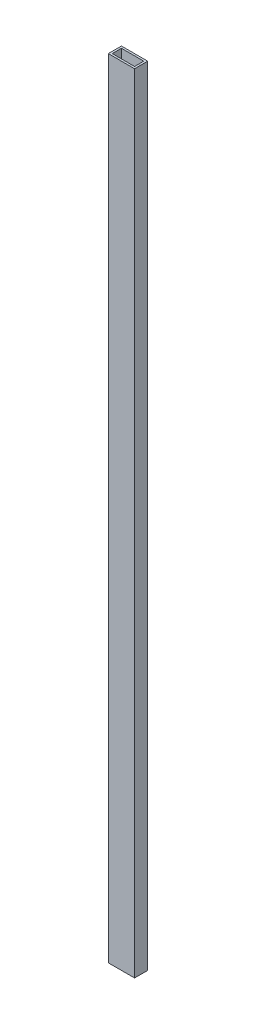
ISO-10303-21;
HEADER;
FILE_DESCRIPTION(('STEP AP214'),'2;1');
FILE_NAME('part.step','',(''),(''),'','','');
FILE_SCHEMA(('AUTOMOTIVE_DESIGN { 1 0 10303 214 1 1 1 1 }'));
ENDSEC;
DATA;
#1=APPLICATION_CONTEXT('core data for automotive mechanical design processes');
#2=APPLICATION_PROTOCOL_DEFINITION('international standard','automotive_design',2000,#1);
#3=PRODUCT_CONTEXT('',#1,'mechanical');
#4=PRODUCT('Part','Part','',(#3));
#5=PRODUCT_RELATED_PRODUCT_CATEGORY('part','',(#4));
#6=PRODUCT_DEFINITION_FORMATION('','',#4);
#7=PRODUCT_DEFINITION_CONTEXT('part definition',#1,'design');
#8=PRODUCT_DEFINITION('design','',#6,#7);
#9=PRODUCT_DEFINITION_SHAPE('','',#8);
#10=(LENGTH_UNIT() NAMED_UNIT(*) SI_UNIT(.MILLI.,.METRE.));
#11=(NAMED_UNIT(*) PLANE_ANGLE_UNIT() SI_UNIT($,.RADIAN.));
#12=(NAMED_UNIT(*) SI_UNIT($,.STERADIAN.) SOLID_ANGLE_UNIT());
#13=UNCERTAINTY_MEASURE_WITH_UNIT(LENGTH_MEASURE(1.E-05),#10,'distance_accuracy_value','');
#14=(GEOMETRIC_REPRESENTATION_CONTEXT(3) GLOBAL_UNCERTAINTY_ASSIGNED_CONTEXT((#13)) GLOBAL_UNIT_ASSIGNED_CONTEXT((#10,
#11,#12)) REPRESENTATION_CONTEXT('',''));
#15=CARTESIAN_POINT('',(0.,0.,0.));
#16=DIRECTION('',(0.,0.,1.));
#17=DIRECTION('',(1.,0.,0.));
#18=AXIS2_PLACEMENT_3D('',#15,#16,#17);
#19=CARTESIAN_POINT('',(0.,1200.,0.));
#20=DIRECTION('',(0.,1.,0.));
#21=DIRECTION('',(0.,0.,1.));
#22=AXIS2_PLACEMENT_3D('',#19,#20,#21);
#23=PLANE('',#22);
#24=DIRECTION('',(0.,0.,-1.));
#25=VECTOR('',#24,1.);
#26=CARTESIAN_POINT('',(20.,1200.,-10.));
#27=LINE('',#26,#25);
#28=CARTESIAN_POINT('',(20.,1200.,10.));
#29=VERTEX_POINT('',#28);
#30=CARTESIAN_POINT('',(20.,1200.,-10.));
#31=VERTEX_POINT('',#30);
#32=EDGE_CURVE('E159',#29,#31,#27,.T.);
#33=ORIENTED_EDGE('',*,*,#32,.T.);
#34=DIRECTION('',(-1.,0.,0.));
#35=VECTOR('',#34,1.);
#36=CARTESIAN_POINT('',(-20.,1200.,-10.));
#37=LINE('',#36,#35);
#38=CARTESIAN_POINT('',(-20.,1200.,-10.));
#39=VERTEX_POINT('',#38);
#40=EDGE_CURVE('E162',#31,#39,#37,.T.);
#41=ORIENTED_EDGE('',*,*,#40,.T.);
#42=DIRECTION('',(0.,0.,1.));
#43=VECTOR('',#42,1.);
#44=CARTESIAN_POINT('',(-20.,1200.,-10.));
#45=LINE('',#44,#43);
#46=CARTESIAN_POINT('',(-20.,1200.,10.));
#47=VERTEX_POINT('',#46);
#48=EDGE_CURVE('E165',#39,#47,#45,.T.);
#49=ORIENTED_EDGE('',*,*,#48,.T.);
#50=DIRECTION('',(1.,0.,0.));
#51=VECTOR('',#50,1.);
#52=CARTESIAN_POINT('',(-20.,1200.,10.));
#53=LINE('',#52,#51);
#54=EDGE_CURVE('E167',#47,#29,#53,.T.);
#55=ORIENTED_EDGE('',*,*,#54,.T.);
#56=EDGE_LOOP('',(#33,#41,#49,#55));
#57=FACE_BOUND('',#56,.T.);
#58=DIRECTION('',(-1.,0.,0.));
#59=VECTOR('',#58,1.);
#60=CARTESIAN_POINT('',(-20.,1200.,-7.));
#61=LINE('',#60,#59);
#62=CARTESIAN_POINT('',(17.,1200.,-7.));
#63=VERTEX_POINT('',#62);
#64=CARTESIAN_POINT('',(-17.,1200.,-7.));
#65=VERTEX_POINT('',#64);
#66=EDGE_CURVE('E131',#63,#65,#61,.T.);
#67=ORIENTED_EDGE('',*,*,#66,.F.);
#68=DIRECTION('',(0.,0.,-1.));
#69=VECTOR('',#68,1.);
#70=CARTESIAN_POINT('',(17.,1200.,-10.));
#71=LINE('',#70,#69);
#72=CARTESIAN_POINT('',(17.,1200.,7.));
#73=VERTEX_POINT('',#72);
#74=EDGE_CURVE('E123',#73,#63,#71,.T.);
#75=ORIENTED_EDGE('',*,*,#74,.F.);
#76=DIRECTION('',(1.,0.,0.));
#77=VECTOR('',#76,1.);
#78=CARTESIAN_POINT('',(-20.,1200.,7.));
#79=LINE('',#78,#77);
#80=CARTESIAN_POINT('',(-17.,1200.,7.));
#81=VERTEX_POINT('',#80);
#82=EDGE_CURVE('E145',#81,#73,#79,.T.);
#83=ORIENTED_EDGE('',*,*,#82,.F.);
#84=DIRECTION('',(0.,0.,1.));
#85=VECTOR('',#84,1.);
#86=CARTESIAN_POINT('',(-17.,1200.,-10.));
#87=LINE('',#86,#85);
#88=EDGE_CURVE('E143',#65,#81,#87,.T.);
#89=ORIENTED_EDGE('',*,*,#88,.F.);
#90=EDGE_LOOP('',(#67,#75,#83,#89));
#91=FACE_BOUND('',#90,.T.);
#92=ADVANCED_FACE('F58',(#57,#91),#23,.T.);
#93=CARTESIAN_POINT('',(0.,0.,0.));
#94=DIRECTION('',(0.,1.,0.));
#95=DIRECTION('',(0.,0.,1.));
#96=AXIS2_PLACEMENT_3D('',#93,#94,#95);
#97=PLANE('',#96);
#98=DIRECTION('',(0.,0.,-1.));
#99=VECTOR('',#98,1.);
#100=CARTESIAN_POINT('',(20.,0.,-10.));
#101=LINE('',#100,#99);
#102=CARTESIAN_POINT('',(20.,0.,10.));
#103=VERTEX_POINT('',#102);
#104=CARTESIAN_POINT('',(20.,0.,-10.));
#105=VERTEX_POINT('',#104);
#106=EDGE_CURVE('E139',#103,#105,#101,.T.);
#107=ORIENTED_EDGE('',*,*,#106,.F.);
#108=DIRECTION('',(1.,0.,0.));
#109=VECTOR('',#108,1.);
#110=CARTESIAN_POINT('',(-20.,0.,10.));
#111=LINE('',#110,#109);
#112=CARTESIAN_POINT('',(-20.,0.,10.));
#113=VERTEX_POINT('',#112);
#114=EDGE_CURVE('E163',#113,#103,#111,.T.);
#115=ORIENTED_EDGE('',*,*,#114,.F.);
#116=DIRECTION('',(0.,0.,1.));
#117=VECTOR('',#116,1.);
#118=CARTESIAN_POINT('',(-20.,0.,-10.));
#119=LINE('',#118,#117);
#120=CARTESIAN_POINT('',(-20.,0.,-10.));
#121=VERTEX_POINT('',#120);
#122=EDGE_CURVE('E174',#121,#113,#119,.T.);
#123=ORIENTED_EDGE('',*,*,#122,.F.);
#124=DIRECTION('',(-1.,0.,0.));
#125=VECTOR('',#124,1.);
#126=CARTESIAN_POINT('',(-20.,0.,-10.));
#127=LINE('',#126,#125);
#128=EDGE_CURVE('E172',#105,#121,#127,.T.);
#129=ORIENTED_EDGE('',*,*,#128,.F.);
#130=EDGE_LOOP('',(#107,#115,#123,#129));
#131=FACE_BOUND('',#130,.T.);
#132=DIRECTION('',(0.,0.,-1.));
#133=VECTOR('',#132,1.);
#134=CARTESIAN_POINT('',(17.,0.,-10.));
#135=LINE('',#134,#133);
#136=CARTESIAN_POINT('',(17.,0.,7.));
#137=VERTEX_POINT('',#136);
#138=CARTESIAN_POINT('',(17.,0.,-7.));
#139=VERTEX_POINT('',#138);
#140=EDGE_CURVE('E81',#137,#139,#135,.T.);
#141=ORIENTED_EDGE('',*,*,#140,.T.);
#142=DIRECTION('',(-1.,0.,0.));
#143=VECTOR('',#142,1.);
#144=CARTESIAN_POINT('',(-20.,0.,-7.));
#145=LINE('',#144,#143);
#146=CARTESIAN_POINT('',(-17.,0.,-7.));
#147=VERTEX_POINT('',#146);
#148=EDGE_CURVE('E138',#139,#147,#145,.T.);
#149=ORIENTED_EDGE('',*,*,#148,.T.);
#150=DIRECTION('',(0.,0.,1.));
#151=VECTOR('',#150,1.);
#152=CARTESIAN_POINT('',(-17.,0.,-10.));
#153=LINE('',#152,#151);
#154=CARTESIAN_POINT('',(-17.,0.,7.));
#155=VERTEX_POINT('',#154);
#156=EDGE_CURVE('E151',#147,#155,#153,.T.);
#157=ORIENTED_EDGE('',*,*,#156,.T.);
#158=DIRECTION('',(1.,0.,0.));
#159=VECTOR('',#158,1.);
#160=CARTESIAN_POINT('',(-20.,0.,7.));
#161=LINE('',#160,#159);
#162=EDGE_CURVE('E132',#155,#137,#161,.T.);
#163=ORIENTED_EDGE('',*,*,#162,.T.);
#164=EDGE_LOOP('',(#141,#149,#157,#163));
#165=FACE_BOUND('',#164,.T.);
#166=ADVANCED_FACE('F192',(#131,#165),#97,.F.);
#167=CARTESIAN_POINT('',(20.,1200.,-10.));
#168=DIRECTION('',(-1.,0.,0.));
#169=DIRECTION('',(0.,0.,1.));
#170=AXIS2_PLACEMENT_3D('',#167,#168,#169);
#171=PLANE('',#170);
#172=ORIENTED_EDGE('',*,*,#106,.T.);
#173=DIRECTION('',(0.,-1.,0.));
#174=VECTOR('',#173,1.);
#175=CARTESIAN_POINT('',(20.,1200.,-10.));
#176=LINE('',#175,#174);
#177=EDGE_CURVE('E12',#31,#105,#176,.T.);
#178=ORIENTED_EDGE('',*,*,#177,.F.);
#179=ORIENTED_EDGE('',*,*,#32,.F.);
#180=DIRECTION('',(0.,-1.,0.));
#181=VECTOR('',#180,1.);
#182=CARTESIAN_POINT('',(20.,1200.,10.));
#183=LINE('',#182,#181);
#184=EDGE_CURVE('E169',#29,#103,#183,.T.);
#185=ORIENTED_EDGE('',*,*,#184,.T.);
#186=EDGE_LOOP('',(#172,#178,#179,#185));
#187=FACE_BOUND('',#186,.T.);
#188=ADVANCED_FACE('F60',(#187),#171,.F.);
#189=CARTESIAN_POINT('',(-20.,1200.,-10.));
#190=DIRECTION('',(0.,0.,1.));
#191=DIRECTION('',(1.,0.,0.));
#192=AXIS2_PLACEMENT_3D('',#189,#190,#191);
#193=PLANE('',#192);
#194=ORIENTED_EDGE('',*,*,#128,.T.);
#195=DIRECTION('',(0.,-1.,0.));
#196=VECTOR('',#195,1.);
#197=CARTESIAN_POINT('',(-20.,1200.,-10.));
#198=LINE('',#197,#196);
#199=EDGE_CURVE('E66',#39,#121,#198,.T.);
#200=ORIENTED_EDGE('',*,*,#199,.F.);
#201=ORIENTED_EDGE('',*,*,#40,.F.);
#202=ORIENTED_EDGE('',*,*,#177,.T.);
#203=EDGE_LOOP('',(#194,#200,#201,#202));
#204=FACE_BOUND('',#203,.T.);
#205=ADVANCED_FACE('F202',(#204),#193,.F.);
#206=CARTESIAN_POINT('',(-20.,1200.,-10.));
#207=DIRECTION('',(1.,0.,0.));
#208=DIRECTION('',(0.,0.,-1.));
#209=AXIS2_PLACEMENT_3D('',#206,#207,#208);
#210=PLANE('',#209);
#211=ORIENTED_EDGE('',*,*,#122,.T.);
#212=DIRECTION('',(0.,-1.,0.));
#213=VECTOR('',#212,1.);
#214=CARTESIAN_POINT('',(-20.,1200.,10.));
#215=LINE('',#214,#213);
#216=EDGE_CURVE('E179',#47,#113,#215,.T.);
#217=ORIENTED_EDGE('',*,*,#216,.F.);
#218=ORIENTED_EDGE('',*,*,#48,.F.);
#219=ORIENTED_EDGE('',*,*,#199,.T.);
#220=EDGE_LOOP('',(#211,#217,#218,#219));
#221=FACE_BOUND('',#220,.T.);
#222=ADVANCED_FACE('F186',(#221),#210,.F.);
#223=CARTESIAN_POINT('',(-20.,1200.,10.));
#224=DIRECTION('',(0.,0.,-1.));
#225=DIRECTION('',(-1.,0.,0.));
#226=AXIS2_PLACEMENT_3D('',#223,#224,#225);
#227=PLANE('',#226);
#228=ORIENTED_EDGE('',*,*,#114,.T.);
#229=ORIENTED_EDGE('',*,*,#184,.F.);
#230=ORIENTED_EDGE('',*,*,#54,.F.);
#231=ORIENTED_EDGE('',*,*,#216,.T.);
#232=EDGE_LOOP('',(#228,#229,#230,#231));
#233=FACE_BOUND('',#232,.T.);
#234=ADVANCED_FACE('F196',(#233),#227,.F.);
#235=CARTESIAN_POINT('',(17.,1200.,-10.));
#236=DIRECTION('',(-1.,0.,0.));
#237=DIRECTION('',(0.,0.,1.));
#238=AXIS2_PLACEMENT_3D('',#235,#236,#237);
#239=PLANE('',#238);
#240=ORIENTED_EDGE('',*,*,#140,.F.);
#241=DIRECTION('',(0.,-1.,0.));
#242=VECTOR('',#241,1.);
#243=CARTESIAN_POINT('',(17.,1200.,7.));
#244=LINE('',#243,#242);
#245=EDGE_CURVE('E127',#73,#137,#244,.T.);
#246=ORIENTED_EDGE('',*,*,#245,.F.);
#247=ORIENTED_EDGE('',*,*,#74,.T.);
#248=DIRECTION('',(0.,-1.,0.));
#249=VECTOR('',#248,1.);
#250=CARTESIAN_POINT('',(17.,1200.,-7.));
#251=LINE('',#250,#249);
#252=EDGE_CURVE('E126',#63,#139,#251,.T.);
#253=ORIENTED_EDGE('',*,*,#252,.T.);
#254=EDGE_LOOP('',(#240,#246,#247,#253));
#255=FACE_BOUND('',#254,.T.);
#256=ADVANCED_FACE('F125',(#255),#239,.T.);
#257=CARTESIAN_POINT('',(-20.,1200.,-7.));
#258=DIRECTION('',(0.,0.,1.));
#259=DIRECTION('',(1.,0.,0.));
#260=AXIS2_PLACEMENT_3D('',#257,#258,#259);
#261=PLANE('',#260);
#262=ORIENTED_EDGE('',*,*,#148,.F.);
#263=ORIENTED_EDGE('',*,*,#252,.F.);
#264=ORIENTED_EDGE('',*,*,#66,.T.);
#265=DIRECTION('',(0.,-1.,0.));
#266=VECTOR('',#265,1.);
#267=CARTESIAN_POINT('',(-17.,1200.,-7.));
#268=LINE('',#267,#266);
#269=EDGE_CURVE('E140',#65,#147,#268,.T.);
#270=ORIENTED_EDGE('',*,*,#269,.T.);
#271=EDGE_LOOP('',(#262,#263,#264,#270));
#272=FACE_BOUND('',#271,.T.);
#273=ADVANCED_FACE('F135',(#272),#261,.T.);
#274=CARTESIAN_POINT('',(-17.,1200.,-10.));
#275=DIRECTION('',(1.,0.,0.));
#276=DIRECTION('',(0.,0.,-1.));
#277=AXIS2_PLACEMENT_3D('',#274,#275,#276);
#278=PLANE('',#277);
#279=ORIENTED_EDGE('',*,*,#156,.F.);
#280=ORIENTED_EDGE('',*,*,#269,.F.);
#281=ORIENTED_EDGE('',*,*,#88,.T.);
#282=DIRECTION('',(0.,-1.,0.));
#283=VECTOR('',#282,1.);
#284=CARTESIAN_POINT('',(-17.,1200.,7.));
#285=LINE('',#284,#283);
#286=EDGE_CURVE('E73',#81,#155,#285,.T.);
#287=ORIENTED_EDGE('',*,*,#286,.T.);
#288=EDGE_LOOP('',(#279,#280,#281,#287));
#289=FACE_BOUND('',#288,.T.);
#290=ADVANCED_FACE('F225',(#289),#278,.T.);
#291=CARTESIAN_POINT('',(-20.,1200.,7.));
#292=DIRECTION('',(0.,0.,-1.));
#293=DIRECTION('',(-1.,0.,0.));
#294=AXIS2_PLACEMENT_3D('',#291,#292,#293);
#295=PLANE('',#294);
#296=ORIENTED_EDGE('',*,*,#162,.F.);
#297=ORIENTED_EDGE('',*,*,#286,.F.);
#298=ORIENTED_EDGE('',*,*,#82,.T.);
#299=ORIENTED_EDGE('',*,*,#245,.T.);
#300=EDGE_LOOP('',(#296,#297,#298,#299));
#301=FACE_BOUND('',#300,.T.);
#302=ADVANCED_FACE('F229',(#301),#295,.T.);
#303=CLOSED_SHELL('',(#92,#166,#188,#205,#222,#234,#256,#273,#290,#302));
#304=MANIFOLD_SOLID_BREP('B2',#303);
#305=ADVANCED_BREP_SHAPE_REPRESENTATION('',(#18,#304),#14);
#306=SHAPE_DEFINITION_REPRESENTATION(#9,#305);
ENDSEC;
END-ISO-10303-21;
